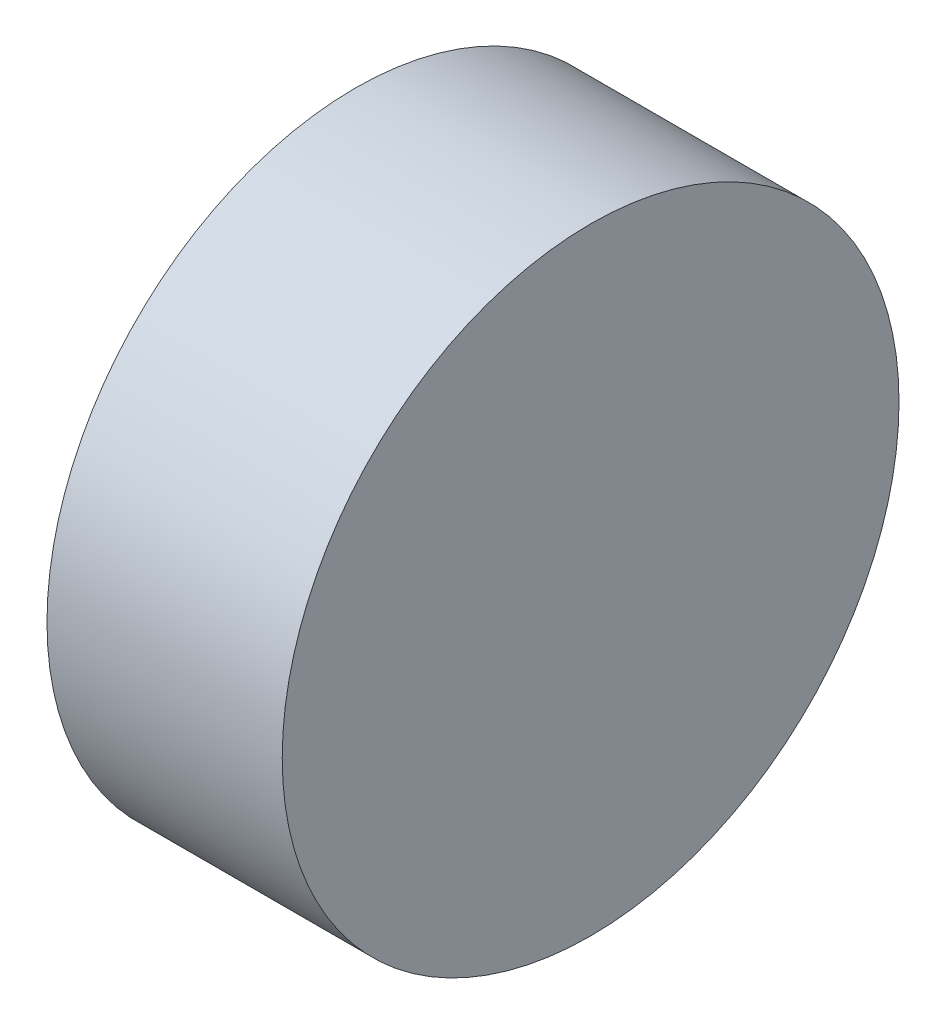
ISO-10303-21;
HEADER;
FILE_DESCRIPTION(('STEP AP214'),'2;1');
FILE_NAME('part.step','',(''),(''),'','','');
FILE_SCHEMA(('AUTOMOTIVE_DESIGN { 1 0 10303 214 1 1 1 1 }'));
ENDSEC;
DATA;
#1=APPLICATION_CONTEXT('core data for automotive mechanical design processes');
#2=APPLICATION_PROTOCOL_DEFINITION('international standard','automotive_design',2000,#1);
#3=PRODUCT_CONTEXT('',#1,'mechanical');
#4=PRODUCT('Part','Part','',(#3));
#5=PRODUCT_RELATED_PRODUCT_CATEGORY('part','',(#4));
#6=PRODUCT_DEFINITION_FORMATION('','',#4);
#7=PRODUCT_DEFINITION_CONTEXT('part definition',#1,'design');
#8=PRODUCT_DEFINITION('design','',#6,#7);
#9=PRODUCT_DEFINITION_SHAPE('','',#8);
#10=(LENGTH_UNIT() NAMED_UNIT(*) SI_UNIT(.MILLI.,.METRE.));
#11=(NAMED_UNIT(*) PLANE_ANGLE_UNIT() SI_UNIT($,.RADIAN.));
#12=(NAMED_UNIT(*) SI_UNIT($,.STERADIAN.) SOLID_ANGLE_UNIT());
#13=UNCERTAINTY_MEASURE_WITH_UNIT(LENGTH_MEASURE(1.E-05),#10,'distance_accuracy_value','');
#14=(GEOMETRIC_REPRESENTATION_CONTEXT(3) GLOBAL_UNCERTAINTY_ASSIGNED_CONTEXT((#13)) GLOBAL_UNIT_ASSIGNED_CONTEXT((#10,
#11,#12)) REPRESENTATION_CONTEXT('',''));
#15=CARTESIAN_POINT('',(0.,0.,0.));
#16=DIRECTION('',(0.,0.,1.));
#17=DIRECTION('',(1.,0.,0.));
#18=AXIS2_PLACEMENT_3D('',#15,#16,#17);
#19=CARTESIAN_POINT('',(-12.7,0.,0.));
#20=DIRECTION('',(1.,0.,0.));
#21=DIRECTION('',(0.,0.,-1.));
#22=AXIS2_PLACEMENT_3D('',#19,#20,#21);
#23=CYLINDRICAL_SURFACE('',#22,33.3);
#24=CARTESIAN_POINT('',(-12.7,0.,0.));
#25=DIRECTION('',(1.,0.,0.));
#26=DIRECTION('',(0.,0.,-1.));
#27=AXIS2_PLACEMENT_3D('',#24,#25,#26);
#28=CIRCLE('',#27,33.3);
#29=CARTESIAN_POINT('',(-12.7,0.,-33.3));
#30=VERTEX_POINT('',#29);
#31=EDGE_CURVE('E10',#30,#30,#28,.T.);
#32=ORIENTED_EDGE('',*,*,#31,.T.);
#33=EDGE_LOOP('',(#32));
#34=FACE_BOUND('',#33,.T.);
#35=CARTESIAN_POINT('',(12.7,0.,0.));
#36=DIRECTION('',(1.,0.,0.));
#37=DIRECTION('',(0.,0.,-1.));
#38=AXIS2_PLACEMENT_3D('',#35,#36,#37);
#39=CIRCLE('',#38,33.3);
#40=CARTESIAN_POINT('',(12.7,0.,-33.3));
#41=VERTEX_POINT('',#40);
#42=EDGE_CURVE('E38',#41,#41,#39,.T.);
#43=ORIENTED_EDGE('',*,*,#42,.F.);
#44=EDGE_LOOP('',(#43));
#45=FACE_BOUND('',#44,.T.);
#46=ADVANCED_FACE('F32',(#34,#45),#23,.T.);
#47=CARTESIAN_POINT('',(-12.7,0.,0.));
#48=DIRECTION('',(1.,0.,0.));
#49=DIRECTION('',(0.,0.,-1.));
#50=AXIS2_PLACEMENT_3D('',#47,#48,#49);
#51=PLANE('',#50);
#52=ORIENTED_EDGE('',*,*,#31,.F.);
#53=EDGE_LOOP('',(#52));
#54=FACE_BOUND('',#53,.T.);
#55=ADVANCED_FACE('F47',(#54),#51,.F.);
#56=CARTESIAN_POINT('',(12.7,0.,0.));
#57=DIRECTION('',(1.,0.,0.));
#58=DIRECTION('',(0.,0.,-1.));
#59=AXIS2_PLACEMENT_3D('',#56,#57,#58);
#60=PLANE('',#59);
#61=ORIENTED_EDGE('',*,*,#42,.T.);
#62=EDGE_LOOP('',(#61));
#63=FACE_BOUND('',#62,.T.);
#64=ADVANCED_FACE('F44',(#63),#60,.T.);
#65=CLOSED_SHELL('',(#46,#55,#64));
#66=MANIFOLD_SOLID_BREP('B2',#65);
#67=ADVANCED_BREP_SHAPE_REPRESENTATION('',(#18,#66),#14);
#68=SHAPE_DEFINITION_REPRESENTATION(#9,#67);
ENDSEC;
END-ISO-10303-21;
